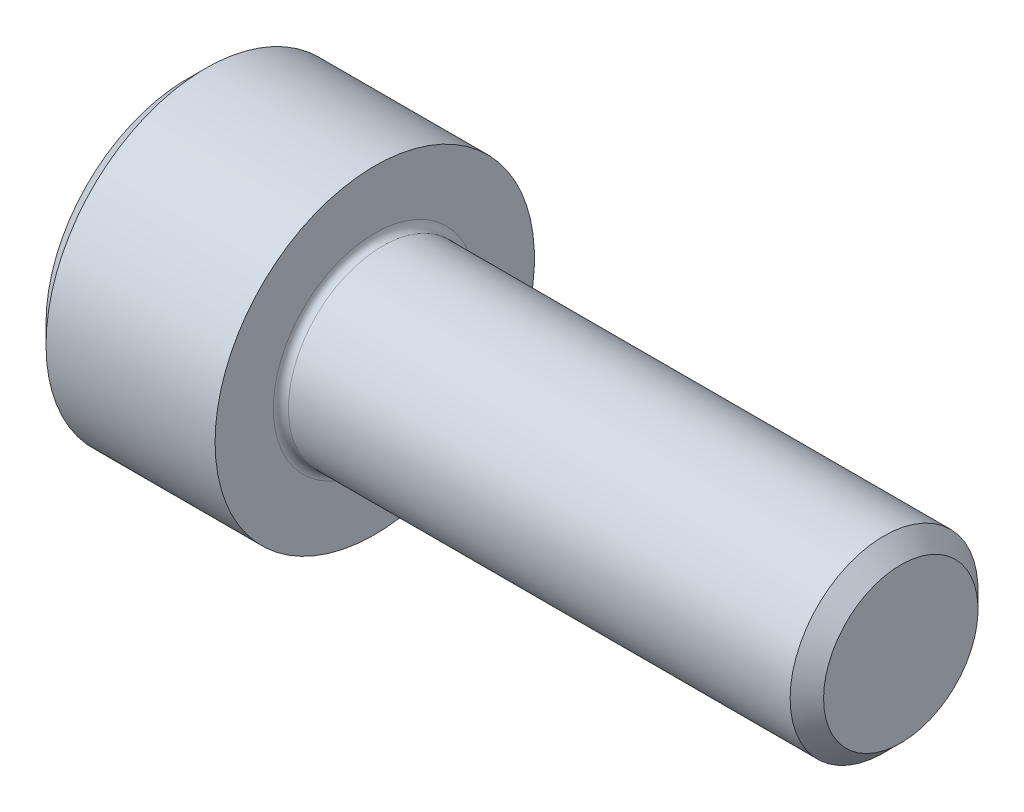
ISO-10303-21;
HEADER;
FILE_DESCRIPTION(('STEP AP214'),'2;1');
FILE_NAME('part.step','',(''),(''),'','','');
FILE_SCHEMA(('AUTOMOTIVE_DESIGN { 1 0 10303 214 1 1 1 1 }'));
ENDSEC;
DATA;
#1=APPLICATION_CONTEXT('core data for automotive mechanical design processes');
#2=APPLICATION_PROTOCOL_DEFINITION('international standard','automotive_design',2000,#1);
#3=PRODUCT_CONTEXT('',#1,'mechanical');
#4=PRODUCT('Part','Part','',(#3));
#5=PRODUCT_RELATED_PRODUCT_CATEGORY('part','',(#4));
#6=PRODUCT_DEFINITION_FORMATION('','',#4);
#7=PRODUCT_DEFINITION_CONTEXT('part definition',#1,'design');
#8=PRODUCT_DEFINITION('design','',#6,#7);
#9=PRODUCT_DEFINITION_SHAPE('','',#8);
#10=(LENGTH_UNIT() NAMED_UNIT(*) SI_UNIT(.MILLI.,.METRE.));
#11=(NAMED_UNIT(*) PLANE_ANGLE_UNIT() SI_UNIT($,.RADIAN.));
#12=(NAMED_UNIT(*) SI_UNIT($,.STERADIAN.) SOLID_ANGLE_UNIT());
#13=UNCERTAINTY_MEASURE_WITH_UNIT(LENGTH_MEASURE(1.E-05),#10,'distance_accuracy_value','');
#14=(GEOMETRIC_REPRESENTATION_CONTEXT(3) GLOBAL_UNCERTAINTY_ASSIGNED_CONTEXT((#13)) GLOBAL_UNIT_ASSIGNED_CONTEXT((#10,
#11,#12)) REPRESENTATION_CONTEXT('',''));
#15=CARTESIAN_POINT('',(0.,0.,0.));
#16=DIRECTION('',(0.,0.,1.));
#17=DIRECTION('',(1.,0.,0.));
#18=AXIS2_PLACEMENT_3D('',#15,#16,#17);
#19=CARTESIAN_POINT('',(0.,0.,0.));
#20=DIRECTION('',(-1.,0.,0.));
#21=DIRECTION('',(0.,0.,1.));
#22=AXIS2_PLACEMENT_3D('',#19,#20,#21);
#23=PLANE('',#22);
#24=DIRECTION('',(0.,-0.5,0.866025403784438));
#25=VECTOR('',#24,1.);
#26=CARTESIAN_POINT('',(0.,2.35789849937043,0.));
#27=LINE('',#26,#25);
#28=CARTESIAN_POINT('',(0.,2.35789849937043,0.));
#29=VERTEX_POINT('',#28);
#30=CARTESIAN_POINT('',(0.,1.17894924968521,2.042));
#31=VERTEX_POINT('',#30);
#32=EDGE_CURVE('E393',#29,#31,#27,.T.);
#33=ORIENTED_EDGE('',*,*,#32,.T.);
#34=DIRECTION('',(0.,1.,0.));
#35=VECTOR('',#34,1.);
#36=CARTESIAN_POINT('',(0.,-1.17894924968522,2.042));
#37=LINE('',#36,#35);
#38=CARTESIAN_POINT('',(0.,-1.17894924968522,2.042));
#39=VERTEX_POINT('',#38);
#40=EDGE_CURVE('E135',#39,#31,#37,.T.);
#41=ORIENTED_EDGE('',*,*,#40,.F.);
#42=DIRECTION('',(0.,-0.500000000000001,-0.866025403784438));
#43=VECTOR('',#42,1.);
#44=CARTESIAN_POINT('',(0.,-1.17894924968522,2.042));
#45=LINE('',#44,#43);
#46=CARTESIAN_POINT('',(0.,-2.35789849937044,0.));
#47=VERTEX_POINT('',#46);
#48=EDGE_CURVE('E396',#39,#47,#45,.T.);
#49=ORIENTED_EDGE('',*,*,#48,.T.);
#50=DIRECTION('',(0.,0.5,-0.866025403784439));
#51=VECTOR('',#50,1.);
#52=CARTESIAN_POINT('',(0.,-2.35789849937044,0.));
#53=LINE('',#52,#51);
#54=CARTESIAN_POINT('',(0.,-1.17894924968522,-2.042));
#55=VERTEX_POINT('',#54);
#56=EDGE_CURVE('E399',#47,#55,#53,.T.);
#57=ORIENTED_EDGE('',*,*,#56,.T.);
#58=DIRECTION('',(0.,-1.,0.));
#59=VECTOR('',#58,1.);
#60=CARTESIAN_POINT('',(0.,1.17894924968521,-2.042));
#61=LINE('',#60,#59);
#62=CARTESIAN_POINT('',(0.,1.17894924968521,-2.042));
#63=VERTEX_POINT('',#62);
#64=EDGE_CURVE('E402',#63,#55,#61,.T.);
#65=ORIENTED_EDGE('',*,*,#64,.F.);
#66=DIRECTION('',(0.,-0.500000000000001,-0.866025403784438));
#67=VECTOR('',#66,1.);
#68=CARTESIAN_POINT('',(0.,2.35789849937043,0.));
#69=LINE('',#68,#67);
#70=EDGE_CURVE('E130',#29,#63,#69,.T.);
#71=ORIENTED_EDGE('',*,*,#70,.F.);
#72=EDGE_LOOP('',(#33,#41,#49,#57,#65,#71));
#73=FACE_BOUND('',#72,.T.);
#74=CARTESIAN_POINT('',(0.,0.,0.));
#75=DIRECTION('',(-1.,0.,0.));
#76=DIRECTION('',(0.,0.,1.));
#77=AXIS2_PLACEMENT_3D('',#74,#75,#76);
#78=CIRCLE('',#77,3.75);
#79=CARTESIAN_POINT('',(0.,0.,3.75));
#80=VERTEX_POINT('',#79);
#81=EDGE_CURVE('E146',#80,#80,#78,.T.);
#82=ORIENTED_EDGE('',*,*,#81,.T.);
#83=EDGE_LOOP('',(#82));
#84=FACE_BOUND('',#83,.T.);
#85=ADVANCED_FACE('F39',(#73,#84),#23,.T.);
#86=CARTESIAN_POINT('',(19.,2.055,0.));
#87=DIRECTION('',(1.,0.,0.));
#88=DIRECTION('',(0.,0.,-1.));
#89=AXIS2_PLACEMENT_3D('',#86,#87,#88);
#90=PLANE('',#89);
#91=CARTESIAN_POINT('',(19.,0.,0.));
#92=DIRECTION('',(-1.,0.,0.));
#93=DIRECTION('',(0.,0.,1.));
#94=AXIS2_PLACEMENT_3D('',#91,#92,#93);
#95=CIRCLE('',#94,2.055);
#96=CARTESIAN_POINT('',(19.,0.,2.055));
#97=VERTEX_POINT('',#96);
#98=EDGE_CURVE('E159',#97,#97,#95,.T.);
#99=ORIENTED_EDGE('',*,*,#98,.F.);
#100=EDGE_LOOP('',(#99));
#101=FACE_BOUND('',#100,.T.);
#102=ADVANCED_FACE('F180',(#101),#90,.T.);
#103=CARTESIAN_POINT('',(19.,0.,0.));
#104=DIRECTION('',(-1.,0.,0.));
#105=DIRECTION('',(0.,0.,1.));
#106=AXIS2_PLACEMENT_3D('',#103,#104,#105);
#107=CONICAL_SURFACE('',#106,2.055,0.785398163397223);
#108=CARTESIAN_POINT('',(18.5549999999999,0.,0.));
#109=DIRECTION('',(-1.,0.,0.));
#110=DIRECTION('',(0.,0.,1.));
#111=AXIS2_PLACEMENT_3D('',#108,#109,#110);
#112=CIRCLE('',#111,2.49999999999989);
#113=CARTESIAN_POINT('',(18.5549999999999,0.,2.49999999999989));
#114=VERTEX_POINT('',#113);
#115=EDGE_CURVE('E156',#114,#114,#112,.T.);
#116=ORIENTED_EDGE('',*,*,#115,.F.);
#117=EDGE_LOOP('',(#116));
#118=FACE_BOUND('',#117,.T.);
#119=ORIENTED_EDGE('',*,*,#98,.T.);
#120=EDGE_LOOP('',(#119));
#121=FACE_BOUND('',#120,.T.);
#122=ADVANCED_FACE('F186',(#118,#121),#107,.T.);
#123=CARTESIAN_POINT('',(-31.75,0.,0.));
#124=DIRECTION('',(-1.,0.,0.));
#125=DIRECTION('',(0.,0.,1.));
#126=AXIS2_PLACEMENT_3D('',#123,#124,#125);
#127=CYLINDRICAL_SURFACE('',#126,2.49999999999995);
#128=CARTESIAN_POINT('',(5.2,0.,0.));
#129=DIRECTION('',(1.,0.,0.));
#130=DIRECTION('',(0.,0.,-1.));
#131=AXIS2_PLACEMENT_3D('',#128,#129,#130);
#132=CIRCLE('',#131,2.49999999999995);
#133=CARTESIAN_POINT('',(5.2,0.,-2.49999999999995));
#134=VERTEX_POINT('',#133);
#135=EDGE_CURVE('E11',#134,#134,#132,.T.);
#136=ORIENTED_EDGE('',*,*,#135,.T.);
#137=EDGE_LOOP('',(#136));
#138=FACE_BOUND('',#137,.T.);
#139=ORIENTED_EDGE('',*,*,#115,.T.);
#140=EDGE_LOOP('',(#139));
#141=FACE_BOUND('',#140,.T.);
#142=ADVANCED_FACE('F197',(#138,#141),#127,.T.);
#143=CARTESIAN_POINT('',(5.,4.25,0.));
#144=DIRECTION('',(1.,0.,0.));
#145=DIRECTION('',(0.,0.,-1.));
#146=AXIS2_PLACEMENT_3D('',#143,#144,#145);
#147=PLANE('',#146);
#148=CARTESIAN_POINT('',(5.,0.,0.));
#149=DIRECTION('',(1.,0.,0.));
#150=DIRECTION('',(0.,0.,-1.));
#151=AXIS2_PLACEMENT_3D('',#148,#149,#150);
#152=CIRCLE('',#151,2.69999999999995);
#153=CARTESIAN_POINT('',(5.,0.,-2.69999999999995));
#154=VERTEX_POINT('',#153);
#155=EDGE_CURVE('E47',#154,#154,#152,.F.);
#156=ORIENTED_EDGE('',*,*,#155,.T.);
#157=EDGE_LOOP('',(#156));
#158=FACE_BOUND('',#157,.T.);
#159=CARTESIAN_POINT('',(5.,0.,0.));
#160=DIRECTION('',(-1.,0.,0.));
#161=DIRECTION('',(0.,0.,1.));
#162=AXIS2_PLACEMENT_3D('',#159,#160,#161);
#163=CIRCLE('',#162,4.25);
#164=CARTESIAN_POINT('',(5.,0.,4.25));
#165=VERTEX_POINT('',#164);
#166=EDGE_CURVE('E153',#165,#165,#163,.T.);
#167=ORIENTED_EDGE('',*,*,#166,.F.);
#168=EDGE_LOOP('',(#167));
#169=FACE_BOUND('',#168,.T.);
#170=ADVANCED_FACE('F164',(#158,#169),#147,.T.);
#171=CARTESIAN_POINT('',(-31.75,0.,0.));
#172=DIRECTION('',(-1.,0.,0.));
#173=DIRECTION('',(0.,0.,1.));
#174=AXIS2_PLACEMENT_3D('',#171,#172,#173);
#175=CYLINDRICAL_SURFACE('',#174,4.25);
#176=ORIENTED_EDGE('',*,*,#166,.T.);
#177=EDGE_LOOP('',(#176));
#178=FACE_BOUND('',#177,.T.);
#179=CARTESIAN_POINT('',(0.5,0.,0.));
#180=DIRECTION('',(-1.,0.,0.));
#181=DIRECTION('',(0.,0.,1.));
#182=AXIS2_PLACEMENT_3D('',#179,#180,#181);
#183=CIRCLE('',#182,4.25);
#184=CARTESIAN_POINT('',(0.5,0.,4.25));
#185=VERTEX_POINT('',#184);
#186=EDGE_CURVE('E150',#185,#185,#183,.T.);
#187=ORIENTED_EDGE('',*,*,#186,.F.);
#188=EDGE_LOOP('',(#187));
#189=FACE_BOUND('',#188,.T.);
#190=ADVANCED_FACE('F175',(#178,#189),#175,.T.);
#191=CARTESIAN_POINT('',(0.,0.,0.));
#192=DIRECTION('',(1.,0.,0.));
#193=DIRECTION('',(0.,0.,-1.));
#194=AXIS2_PLACEMENT_3D('',#191,#192,#193);
#195=CONICAL_SURFACE('',#194,3.75,0.785398163397449);
#196=ORIENTED_EDGE('',*,*,#186,.T.);
#197=EDGE_LOOP('',(#196));
#198=FACE_BOUND('',#197,.T.);
#199=ORIENTED_EDGE('',*,*,#81,.F.);
#200=EDGE_LOOP('',(#199));
#201=FACE_BOUND('',#200,.T.);
#202=ADVANCED_FACE('F168',(#198,#201),#195,.T.);
#203=CARTESIAN_POINT('',(5.2,0.,0.));
#204=DIRECTION('',(1.,0.,0.));
#205=DIRECTION('',(0.,0.,-1.));
#206=AXIS2_PLACEMENT_3D('',#203,#204,#205);
#207=TOROIDAL_SURFACE('',#206,2.69999999999995,0.2);
#208=ORIENTED_EDGE('',*,*,#135,.F.);
#209=EDGE_LOOP('',(#208));
#210=FACE_BOUND('',#209,.T.);
#211=ORIENTED_EDGE('',*,*,#155,.F.);
#212=EDGE_LOOP('',(#211));
#213=FACE_BOUND('',#212,.T.);
#214=ADVANCED_FACE('F41',(#210,#213),#207,.F.);
#215=CARTESIAN_POINT('',(2.5,2.35789849937043,0.));
#216=DIRECTION('',(0.,-0.866025403784439,-0.5));
#217=DIRECTION('',(0.,0.5,-0.866025403784439));
#218=AXIS2_PLACEMENT_3D('',#215,#216,#217);
#219=PLANE('',#218);
#220=ORIENTED_EDGE('',*,*,#32,.F.);
#221=DIRECTION('',(-1.,0.,0.));
#222=VECTOR('',#221,1.);
#223=CARTESIAN_POINT('',(2.5,2.35789849937043,0.));
#224=LINE('',#223,#222);
#225=CARTESIAN_POINT('',(2.5,2.35789849937043,0.));
#226=VERTEX_POINT('',#225);
#227=EDGE_CURVE('E383',#226,#29,#224,.T.);
#228=ORIENTED_EDGE('',*,*,#227,.F.);
#229=DIRECTION('',(0.,-0.5,0.866025403784438));
#230=VECTOR('',#229,1.);
#231=CARTESIAN_POINT('',(2.5,2.35789849937043,0.));
#232=LINE('',#231,#230);
#233=CARTESIAN_POINT('',(2.5,1.76842387452782,1.021));
#234=VERTEX_POINT('',#233);
#235=EDGE_CURVE('E122',#226,#234,#232,.T.);
#236=ORIENTED_EDGE('',*,*,#235,.T.);
#237=CARTESIAN_POINT('',(2.5,1.17894924968521,2.042));
#238=VERTEX_POINT('',#237);
#239=EDGE_CURVE('E113',#234,#238,#232,.T.);
#240=ORIENTED_EDGE('',*,*,#239,.T.);
#241=DIRECTION('',(-1.,0.,0.));
#242=VECTOR('',#241,1.);
#243=CARTESIAN_POINT('',(2.5,1.17894924968521,2.042));
#244=LINE('',#243,#242);
#245=EDGE_CURVE('E127',#238,#31,#244,.T.);
#246=ORIENTED_EDGE('',*,*,#245,.T.);
#247=EDGE_LOOP('',(#220,#228,#236,#240,#246));
#248=FACE_BOUND('',#247,.T.);
#249=ADVANCED_FACE('F126',(#248),#219,.T.);
#250=CARTESIAN_POINT('',(2.5,-1.17894924968522,2.042));
#251=DIRECTION('',(0.,0.,1.));
#252=DIRECTION('',(0.,-1.,0.));
#253=AXIS2_PLACEMENT_3D('',#250,#251,#252);
#254=PLANE('',#253);
#255=ORIENTED_EDGE('',*,*,#40,.T.);
#256=ORIENTED_EDGE('',*,*,#245,.F.);
#257=DIRECTION('',(0.,1.,0.));
#258=VECTOR('',#257,1.);
#259=CARTESIAN_POINT('',(2.5,-1.17894924968522,2.042));
#260=LINE('',#259,#258);
#261=CARTESIAN_POINT('',(2.5,0.,2.042));
#262=VERTEX_POINT('',#261);
#263=EDGE_CURVE('E110',#262,#238,#260,.T.);
#264=ORIENTED_EDGE('',*,*,#263,.F.);
#265=CARTESIAN_POINT('',(2.5,-1.17894924968522,2.042));
#266=VERTEX_POINT('',#265);
#267=EDGE_CURVE('E121',#266,#262,#260,.T.);
#268=ORIENTED_EDGE('',*,*,#267,.F.);
#269=DIRECTION('',(-1.,0.,0.));
#270=VECTOR('',#269,1.);
#271=CARTESIAN_POINT('',(2.5,-1.17894924968522,2.042));
#272=LINE('',#271,#270);
#273=EDGE_CURVE('E137',#266,#39,#272,.T.);
#274=ORIENTED_EDGE('',*,*,#273,.T.);
#275=EDGE_LOOP('',(#255,#256,#264,#268,#274));
#276=FACE_BOUND('',#275,.T.);
#277=ADVANCED_FACE('F132',(#276),#254,.F.);
#278=CARTESIAN_POINT('',(2.5,-1.17894924968522,2.042));
#279=DIRECTION('',(0.,0.866025403784438,-0.500000000000001));
#280=DIRECTION('',(0.,0.500000000000001,0.866025403784438));
#281=AXIS2_PLACEMENT_3D('',#278,#279,#280);
#282=PLANE('',#281);
#283=ORIENTED_EDGE('',*,*,#48,.F.);
#284=ORIENTED_EDGE('',*,*,#273,.F.);
#285=DIRECTION('',(0.,-0.500000000000001,-0.866025403784438));
#286=VECTOR('',#285,1.);
#287=CARTESIAN_POINT('',(2.5,-1.17894924968522,2.042));
#288=LINE('',#287,#286);
#289=CARTESIAN_POINT('',(2.5,-1.76842387452782,1.021));
#290=VERTEX_POINT('',#289);
#291=EDGE_CURVE('E422',#266,#290,#288,.T.);
#292=ORIENTED_EDGE('',*,*,#291,.T.);
#293=CARTESIAN_POINT('',(2.5,-2.35789849937044,0.));
#294=VERTEX_POINT('',#293);
#295=EDGE_CURVE('E411',#290,#294,#288,.T.);
#296=ORIENTED_EDGE('',*,*,#295,.T.);
#297=DIRECTION('',(-1.,0.,0.));
#298=VECTOR('',#297,1.);
#299=CARTESIAN_POINT('',(2.5,-2.35789849937044,0.));
#300=LINE('',#299,#298);
#301=EDGE_CURVE('E142',#294,#47,#300,.T.);
#302=ORIENTED_EDGE('',*,*,#301,.T.);
#303=EDGE_LOOP('',(#283,#284,#292,#296,#302));
#304=FACE_BOUND('',#303,.T.);
#305=ADVANCED_FACE('F274',(#304),#282,.T.);
#306=CARTESIAN_POINT('',(2.5,-2.35789849937044,0.));
#307=DIRECTION('',(0.,0.866025403784439,0.5));
#308=DIRECTION('',(0.,-0.5,0.866025403784439));
#309=AXIS2_PLACEMENT_3D('',#306,#307,#308);
#310=PLANE('',#309);
#311=ORIENTED_EDGE('',*,*,#56,.F.);
#312=ORIENTED_EDGE('',*,*,#301,.F.);
#313=DIRECTION('',(0.,0.5,-0.866025403784439));
#314=VECTOR('',#313,1.);
#315=CARTESIAN_POINT('',(2.5,-2.35789849937044,0.));
#316=LINE('',#315,#314);
#317=CARTESIAN_POINT('',(2.5,-1.76842387452783,-1.021));
#318=VERTEX_POINT('',#317);
#319=EDGE_CURVE('E389',#294,#318,#316,.T.);
#320=ORIENTED_EDGE('',*,*,#319,.T.);
#321=CARTESIAN_POINT('',(2.5,-1.17894924968522,-2.042));
#322=VERTEX_POINT('',#321);
#323=EDGE_CURVE('E421',#318,#322,#316,.T.);
#324=ORIENTED_EDGE('',*,*,#323,.T.);
#325=DIRECTION('',(-1.,0.,0.));
#326=VECTOR('',#325,1.);
#327=CARTESIAN_POINT('',(2.5,-1.17894924968522,-2.042));
#328=LINE('',#327,#326);
#329=EDGE_CURVE('E382',#322,#55,#328,.T.);
#330=ORIENTED_EDGE('',*,*,#329,.T.);
#331=EDGE_LOOP('',(#311,#312,#320,#324,#330));
#332=FACE_BOUND('',#331,.T.);
#333=ADVANCED_FACE('F282',(#332),#310,.T.);
#334=CARTESIAN_POINT('',(2.5,1.17894924968521,-2.042));
#335=DIRECTION('',(0.,0.,-1.));
#336=DIRECTION('',(0.,1.,0.));
#337=AXIS2_PLACEMENT_3D('',#334,#335,#336);
#338=PLANE('',#337);
#339=ORIENTED_EDGE('',*,*,#64,.T.);
#340=ORIENTED_EDGE('',*,*,#329,.F.);
#341=DIRECTION('',(0.,-1.,0.));
#342=VECTOR('',#341,1.);
#343=CARTESIAN_POINT('',(2.5,1.17894924968521,-2.042));
#344=LINE('',#343,#342);
#345=CARTESIAN_POINT('',(2.5,0.,-2.042));
#346=VERTEX_POINT('',#345);
#347=EDGE_CURVE('E386',#346,#322,#344,.T.);
#348=ORIENTED_EDGE('',*,*,#347,.F.);
#349=CARTESIAN_POINT('',(2.5,1.17894924968521,-2.042));
#350=VERTEX_POINT('',#349);
#351=EDGE_CURVE('E54',#350,#346,#344,.T.);
#352=ORIENTED_EDGE('',*,*,#351,.F.);
#353=DIRECTION('',(-1.,0.,0.));
#354=VECTOR('',#353,1.);
#355=CARTESIAN_POINT('',(2.5,1.17894924968521,-2.042));
#356=LINE('',#355,#354);
#357=EDGE_CURVE('E379',#350,#63,#356,.T.);
#358=ORIENTED_EDGE('',*,*,#357,.T.);
#359=EDGE_LOOP('',(#339,#340,#348,#352,#358));
#360=FACE_BOUND('',#359,.T.);
#361=ADVANCED_FACE('F291',(#360),#338,.F.);
#362=CARTESIAN_POINT('',(2.5,2.35789849937043,0.));
#363=DIRECTION('',(0.,0.866025403784438,-0.500000000000001));
#364=DIRECTION('',(0.,0.500000000000001,0.866025403784438));
#365=AXIS2_PLACEMENT_3D('',#362,#363,#364);
#366=PLANE('',#365);
#367=ORIENTED_EDGE('',*,*,#70,.T.);
#368=ORIENTED_EDGE('',*,*,#357,.F.);
#369=DIRECTION('',(0.,-0.500000000000001,-0.866025403784438));
#370=VECTOR('',#369,1.);
#371=CARTESIAN_POINT('',(2.5,2.35789849937043,0.));
#372=LINE('',#371,#370);
#373=CARTESIAN_POINT('',(2.5,1.76842387452782,-1.021));
#374=VERTEX_POINT('',#373);
#375=EDGE_CURVE('E369',#374,#350,#372,.T.);
#376=ORIENTED_EDGE('',*,*,#375,.F.);
#377=EDGE_CURVE('E375',#226,#374,#372,.T.);
#378=ORIENTED_EDGE('',*,*,#377,.F.);
#379=ORIENTED_EDGE('',*,*,#227,.T.);
#380=EDGE_LOOP('',(#367,#368,#376,#378,#379));
#381=FACE_BOUND('',#380,.T.);
#382=ADVANCED_FACE('F300',(#381),#366,.F.);
#383=CARTESIAN_POINT('',(2.5,2.35789849937043,0.));
#384=DIRECTION('',(1.,0.,0.));
#385=DIRECTION('',(0.,0.,-1.));
#386=AXIS2_PLACEMENT_3D('',#383,#384,#385);
#387=PLANE('',#386);
#388=ORIENTED_EDGE('',*,*,#347,.T.);
#389=ORIENTED_EDGE('',*,*,#323,.F.);
#390=CARTESIAN_POINT('',(2.5,0.,0.));
#391=DIRECTION('',(-1.,0.,0.));
#392=DIRECTION('',(0.,0.,1.));
#393=AXIS2_PLACEMENT_3D('',#390,#391,#392);
#394=CIRCLE('',#393,2.042);
#395=EDGE_CURVE('E417',#346,#318,#394,.T.);
#396=ORIENTED_EDGE('',*,*,#395,.F.);
#397=EDGE_LOOP('',(#388,#389,#396));
#398=FACE_BOUND('',#397,.T.);
#399=ADVANCED_FACE('F309',(#398),#387,.F.);
#400=ORIENTED_EDGE('',*,*,#319,.F.);
#401=ORIENTED_EDGE('',*,*,#295,.F.);
#402=EDGE_CURVE('E140',#318,#290,#394,.T.);
#403=ORIENTED_EDGE('',*,*,#402,.F.);
#404=EDGE_LOOP('',(#400,#401,#403));
#405=FACE_BOUND('',#404,.T.);
#406=ADVANCED_FACE('F318',(#405),#387,.F.);
#407=ORIENTED_EDGE('',*,*,#291,.F.);
#408=ORIENTED_EDGE('',*,*,#267,.T.);
#409=EDGE_CURVE('E136',#290,#262,#394,.T.);
#410=ORIENTED_EDGE('',*,*,#409,.F.);
#411=EDGE_LOOP('',(#407,#408,#410));
#412=FACE_BOUND('',#411,.T.);
#413=ADVANCED_FACE('F327',(#412),#387,.F.);
#414=ORIENTED_EDGE('',*,*,#263,.T.);
#415=ORIENTED_EDGE('',*,*,#239,.F.);
#416=EDGE_CURVE('E116',#262,#234,#394,.T.);
#417=ORIENTED_EDGE('',*,*,#416,.F.);
#418=EDGE_LOOP('',(#414,#415,#417));
#419=FACE_BOUND('',#418,.T.);
#420=ADVANCED_FACE('F112',(#419),#387,.F.);
#421=ORIENTED_EDGE('',*,*,#235,.F.);
#422=ORIENTED_EDGE('',*,*,#377,.T.);
#423=EDGE_CURVE('E147',#234,#374,#394,.T.);
#424=ORIENTED_EDGE('',*,*,#423,.F.);
#425=EDGE_LOOP('',(#421,#422,#424));
#426=FACE_BOUND('',#425,.T.);
#427=ADVANCED_FACE('F342',(#426),#387,.F.);
#428=ORIENTED_EDGE('',*,*,#375,.T.);
#429=ORIENTED_EDGE('',*,*,#351,.T.);
#430=EDGE_CURVE('E372',#374,#346,#394,.T.);
#431=ORIENTED_EDGE('',*,*,#430,.F.);
#432=EDGE_LOOP('',(#428,#429,#431));
#433=FACE_BOUND('',#432,.T.);
#434=ADVANCED_FACE('F257',(#433),#387,.F.);
#435=CARTESIAN_POINT('',(2.5,0.,0.));
#436=DIRECTION('',(-1.,0.,0.));
#437=DIRECTION('',(0.,0.,1.));
#438=AXIS2_PLACEMENT_3D('',#435,#436,#437);
#439=CONICAL_SURFACE('',#438,2.042,1.04719755119659);
#440=CARTESIAN_POINT('',(3.67894924968522,0.,0.));
#441=VERTEX_POINT('',#440);
#442=VERTEX_LOOP('',#441);
#443=FACE_BOUND('',#442,.T.);
#444=ORIENTED_EDGE('',*,*,#416,.T.);
#445=ORIENTED_EDGE('',*,*,#423,.T.);
#446=ORIENTED_EDGE('',*,*,#430,.T.);
#447=ORIENTED_EDGE('',*,*,#395,.T.);
#448=ORIENTED_EDGE('',*,*,#402,.T.);
#449=ORIENTED_EDGE('',*,*,#409,.T.);
#450=EDGE_LOOP('',(#444,#445,#446,#447,#448,#449));
#451=FACE_BOUND('',#450,.T.);
#452=ADVANCED_FACE('F190',(#443,#451),#439,.F.);
#453=CLOSED_SHELL('',(#85,#102,#122,#142,#170,#190,#202,#214,#249,#277,#305,#333,#361,#382,#399,
#406,#413,#420,#427,#434,#452));
#454=MANIFOLD_SOLID_BREP('B2',#453);
#455=ADVANCED_BREP_SHAPE_REPRESENTATION('',(#18,#454),#14);
#456=SHAPE_DEFINITION_REPRESENTATION(#9,#455);
ENDSEC;
END-ISO-10303-21;
